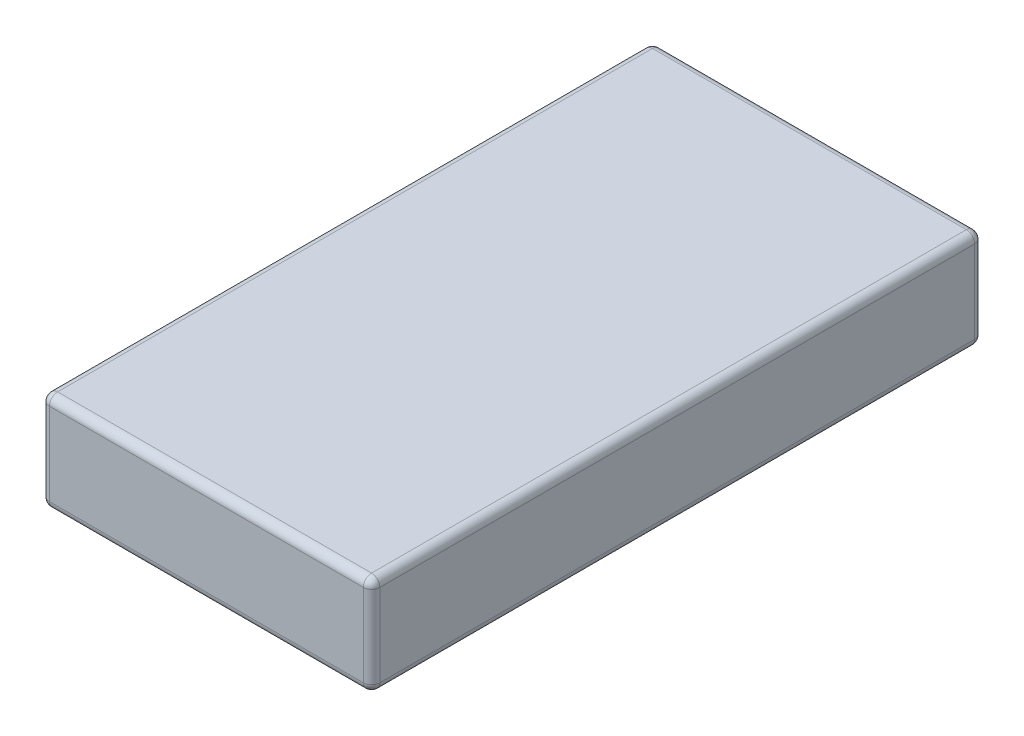
ISO-10303-21;
HEADER;
FILE_DESCRIPTION(('STEP AP214'),'2;1');
FILE_NAME('part.step','',(''),(''),'','','');
FILE_SCHEMA(('AUTOMOTIVE_DESIGN { 1 0 10303 214 1 1 1 1 }'));
ENDSEC;
DATA;
#1=APPLICATION_CONTEXT('core data for automotive mechanical design processes');
#2=APPLICATION_PROTOCOL_DEFINITION('international standard','automotive_design',2000,#1);
#3=PRODUCT_CONTEXT('',#1,'mechanical');
#4=PRODUCT('Part','Part','',(#3));
#5=PRODUCT_RELATED_PRODUCT_CATEGORY('part','',(#4));
#6=PRODUCT_DEFINITION_FORMATION('','',#4);
#7=PRODUCT_DEFINITION_CONTEXT('part definition',#1,'design');
#8=PRODUCT_DEFINITION('design','',#6,#7);
#9=PRODUCT_DEFINITION_SHAPE('','',#8);
#10=(LENGTH_UNIT() NAMED_UNIT(*) SI_UNIT(.MILLI.,.METRE.));
#11=(NAMED_UNIT(*) PLANE_ANGLE_UNIT() SI_UNIT($,.RADIAN.));
#12=(NAMED_UNIT(*) SI_UNIT($,.STERADIAN.) SOLID_ANGLE_UNIT());
#13=UNCERTAINTY_MEASURE_WITH_UNIT(LENGTH_MEASURE(1.E-05),#10,'distance_accuracy_value','');
#14=(GEOMETRIC_REPRESENTATION_CONTEXT(3) GLOBAL_UNCERTAINTY_ASSIGNED_CONTEXT((#13)) GLOBAL_UNIT_ASSIGNED_CONTEXT((#10,
#11,#12)) REPRESENTATION_CONTEXT('',''));
#15=CARTESIAN_POINT('',(0.,0.,0.));
#16=DIRECTION('',(0.,0.,1.));
#17=DIRECTION('',(1.,0.,0.));
#18=AXIS2_PLACEMENT_3D('',#15,#16,#17);
#19=CARTESIAN_POINT('',(10.,6.,18.5));
#20=DIRECTION('',(-1.,0.,0.));
#21=DIRECTION('',(0.,0.,1.));
#22=AXIS2_PLACEMENT_3D('',#19,#20,#21);
#23=PLANE('',#22);
#24=DIRECTION('',(0.,-1.,0.));
#25=VECTOR('',#24,1.);
#26=CARTESIAN_POINT('',(10.,6.,18.));
#27=LINE('',#26,#25);
#28=CARTESIAN_POINT('',(10.,5.5,18.));
#29=VERTEX_POINT('',#28);
#30=CARTESIAN_POINT('',(10.,0.5,18.));
#31=VERTEX_POINT('',#30);
#32=EDGE_CURVE('E208',#29,#31,#27,.T.);
#33=ORIENTED_EDGE('',*,*,#32,.T.);
#34=DIRECTION('',(0.,0.,-1.));
#35=VECTOR('',#34,1.);
#36=CARTESIAN_POINT('',(10.,0.5,-18.5));
#37=LINE('',#36,#35);
#38=CARTESIAN_POINT('',(10.,0.5,-18.));
#39=VERTEX_POINT('',#38);
#40=EDGE_CURVE('E212',#31,#39,#37,.T.);
#41=ORIENTED_EDGE('',*,*,#40,.T.);
#42=DIRECTION('',(0.,-1.,0.));
#43=VECTOR('',#42,1.);
#44=CARTESIAN_POINT('',(10.,6.,-18.));
#45=LINE('',#44,#43);
#46=CARTESIAN_POINT('',(10.,5.5,-18.));
#47=VERTEX_POINT('',#46);
#48=EDGE_CURVE('E205',#39,#47,#45,.F.);
#49=ORIENTED_EDGE('',*,*,#48,.T.);
#50=DIRECTION('',(0.,0.,-1.));
#51=VECTOR('',#50,1.);
#52=CARTESIAN_POINT('',(10.,5.5,18.5));
#53=LINE('',#52,#51);
#54=EDGE_CURVE('E202',#47,#29,#53,.F.);
#55=ORIENTED_EDGE('',*,*,#54,.T.);
#56=EDGE_LOOP('',(#33,#41,#49,#55));
#57=FACE_BOUND('',#56,.T.);
#58=ADVANCED_FACE('F39',(#57),#23,.F.);
#59=CARTESIAN_POINT('',(-10.,6.,-18.5));
#60=DIRECTION('',(0.,0.,1.));
#61=DIRECTION('',(1.,0.,0.));
#62=AXIS2_PLACEMENT_3D('',#59,#60,#61);
#63=PLANE('',#62);
#64=DIRECTION('',(0.,-1.,0.));
#65=VECTOR('',#64,1.);
#66=CARTESIAN_POINT('',(9.5,6.,-18.5));
#67=LINE('',#66,#65);
#68=CARTESIAN_POINT('',(9.5,5.5,-18.5));
#69=VERTEX_POINT('',#68);
#70=CARTESIAN_POINT('',(9.5,0.5,-18.5));
#71=VERTEX_POINT('',#70);
#72=EDGE_CURVE('E181',#69,#71,#67,.T.);
#73=ORIENTED_EDGE('',*,*,#72,.T.);
#74=DIRECTION('',(-1.,0.,0.));
#75=VECTOR('',#74,1.);
#76=CARTESIAN_POINT('',(-10.,0.5,-18.5));
#77=LINE('',#76,#75);
#78=CARTESIAN_POINT('',(-9.5,0.5,-18.5));
#79=VERTEX_POINT('',#78);
#80=EDGE_CURVE('E188',#71,#79,#77,.T.);
#81=ORIENTED_EDGE('',*,*,#80,.T.);
#82=DIRECTION('',(0.,-1.,0.));
#83=VECTOR('',#82,1.);
#84=CARTESIAN_POINT('',(-9.5,6.,-18.5));
#85=LINE('',#84,#83);
#86=CARTESIAN_POINT('',(-9.5,5.5,-18.5));
#87=VERTEX_POINT('',#86);
#88=EDGE_CURVE('E184',#79,#87,#85,.F.);
#89=ORIENTED_EDGE('',*,*,#88,.T.);
#90=DIRECTION('',(-1.,0.,0.));
#91=VECTOR('',#90,1.);
#92=CARTESIAN_POINT('',(-10.,5.5,-18.5));
#93=LINE('',#92,#91);
#94=EDGE_CURVE('E178',#87,#69,#93,.F.);
#95=ORIENTED_EDGE('',*,*,#94,.T.);
#96=EDGE_LOOP('',(#73,#81,#89,#95));
#97=FACE_BOUND('',#96,.T.);
#98=ADVANCED_FACE('F359',(#97),#63,.F.);
#99=CARTESIAN_POINT('',(-10.,6.,18.5));
#100=DIRECTION('',(1.,0.,0.));
#101=DIRECTION('',(0.,0.,-1.));
#102=AXIS2_PLACEMENT_3D('',#99,#100,#101);
#103=PLANE('',#102);
#104=DIRECTION('',(0.,-1.,0.));
#105=VECTOR('',#104,1.);
#106=CARTESIAN_POINT('',(-10.,6.,-18.));
#107=LINE('',#106,#105);
#108=CARTESIAN_POINT('',(-10.,5.5,-18.));
#109=VERTEX_POINT('',#108);
#110=CARTESIAN_POINT('',(-10.,0.5,-18.));
#111=VERTEX_POINT('',#110);
#112=EDGE_CURVE('E140',#109,#111,#107,.T.);
#113=ORIENTED_EDGE('',*,*,#112,.T.);
#114=DIRECTION('',(0.,0.,1.));
#115=VECTOR('',#114,1.);
#116=CARTESIAN_POINT('',(-10.,0.5,18.5));
#117=LINE('',#116,#115);
#118=CARTESIAN_POINT('',(-10.,0.5,18.));
#119=VERTEX_POINT('',#118);
#120=EDGE_CURVE('E135',#111,#119,#117,.T.);
#121=ORIENTED_EDGE('',*,*,#120,.T.);
#122=DIRECTION('',(0.,-1.,0.));
#123=VECTOR('',#122,1.);
#124=CARTESIAN_POINT('',(-10.,6.,18.));
#125=LINE('',#124,#123);
#126=CARTESIAN_POINT('',(-10.,5.5,18.));
#127=VERTEX_POINT('',#126);
#128=EDGE_CURVE('E127',#119,#127,#125,.F.);
#129=ORIENTED_EDGE('',*,*,#128,.T.);
#130=DIRECTION('',(0.,0.,1.));
#131=VECTOR('',#130,1.);
#132=CARTESIAN_POINT('',(-10.,5.5,18.5));
#133=LINE('',#132,#131);
#134=EDGE_CURVE('E132',#127,#109,#133,.F.);
#135=ORIENTED_EDGE('',*,*,#134,.T.);
#136=EDGE_LOOP('',(#113,#121,#129,#135));
#137=FACE_BOUND('',#136,.T.);
#138=ADVANCED_FACE('F130',(#137),#103,.F.);
#139=CARTESIAN_POINT('',(-10.,6.,18.5));
#140=DIRECTION('',(0.,0.,-1.));
#141=DIRECTION('',(-1.,0.,0.));
#142=AXIS2_PLACEMENT_3D('',#139,#140,#141);
#143=PLANE('',#142);
#144=DIRECTION('',(0.,-1.,0.));
#145=VECTOR('',#144,1.);
#146=CARTESIAN_POINT('',(-9.5,6.,18.5));
#147=LINE('',#146,#145);
#148=CARTESIAN_POINT('',(-9.5,5.5,18.5));
#149=VERTEX_POINT('',#148);
#150=CARTESIAN_POINT('',(-9.5,0.5,18.5));
#151=VERTEX_POINT('',#150);
#152=EDGE_CURVE('E148',#149,#151,#147,.T.);
#153=ORIENTED_EDGE('',*,*,#152,.T.);
#154=DIRECTION('',(1.,0.,0.));
#155=VECTOR('',#154,1.);
#156=CARTESIAN_POINT('',(10.,0.5,18.5));
#157=LINE('',#156,#155);
#158=CARTESIAN_POINT('',(9.5,0.5,18.5));
#159=VERTEX_POINT('',#158);
#160=EDGE_CURVE('E199',#151,#159,#157,.T.);
#161=ORIENTED_EDGE('',*,*,#160,.T.);
#162=DIRECTION('',(0.,-1.,0.));
#163=VECTOR('',#162,1.);
#164=CARTESIAN_POINT('',(9.5,6.,18.5));
#165=LINE('',#164,#163);
#166=CARTESIAN_POINT('',(9.5,5.5,18.5));
#167=VERTEX_POINT('',#166);
#168=EDGE_CURVE('E194',#159,#167,#165,.F.);
#169=ORIENTED_EDGE('',*,*,#168,.T.);
#170=DIRECTION('',(1.,0.,0.));
#171=VECTOR('',#170,1.);
#172=CARTESIAN_POINT('',(-10.,5.5,18.5));
#173=LINE('',#172,#171);
#174=EDGE_CURVE('E191',#167,#149,#173,.F.);
#175=ORIENTED_EDGE('',*,*,#174,.T.);
#176=EDGE_LOOP('',(#153,#161,#169,#175));
#177=FACE_BOUND('',#176,.T.);
#178=ADVANCED_FACE('F350',(#177),#143,.F.);
#179=CARTESIAN_POINT('',(0.,6.,0.));
#180=DIRECTION('',(0.,-1.,0.));
#181=DIRECTION('',(0.,0.,-1.));
#182=AXIS2_PLACEMENT_3D('',#179,#180,#181);
#183=PLANE('',#182);
#184=DIRECTION('',(0.,0.,1.));
#185=VECTOR('',#184,1.);
#186=CARTESIAN_POINT('',(-9.5,6.,0.));
#187=LINE('',#186,#185);
#188=CARTESIAN_POINT('',(-9.5,6.,-18.));
#189=VERTEX_POINT('',#188);
#190=CARTESIAN_POINT('',(-9.5,6.,18.));
#191=VERTEX_POINT('',#190);
#192=EDGE_CURVE('E49',#189,#191,#187,.T.);
#193=ORIENTED_EDGE('',*,*,#192,.T.);
#194=DIRECTION('',(1.,0.,0.));
#195=VECTOR('',#194,1.);
#196=CARTESIAN_POINT('',(0.,6.,18.));
#197=LINE('',#196,#195);
#198=CARTESIAN_POINT('',(9.5,6.,18.));
#199=VERTEX_POINT('',#198);
#200=EDGE_CURVE('E11',#191,#199,#197,.T.);
#201=ORIENTED_EDGE('',*,*,#200,.T.);
#202=DIRECTION('',(0.,0.,-1.));
#203=VECTOR('',#202,1.);
#204=CARTESIAN_POINT('',(9.5,6.,0.));
#205=LINE('',#204,#203);
#206=CARTESIAN_POINT('',(9.5,6.,-18.));
#207=VERTEX_POINT('',#206);
#208=EDGE_CURVE('E228',#199,#207,#205,.T.);
#209=ORIENTED_EDGE('',*,*,#208,.T.);
#210=DIRECTION('',(-1.,0.,0.));
#211=VECTOR('',#210,1.);
#212=CARTESIAN_POINT('',(0.,6.,-18.));
#213=LINE('',#212,#211);
#214=EDGE_CURVE('E60',#207,#189,#213,.T.);
#215=ORIENTED_EDGE('',*,*,#214,.T.);
#216=EDGE_LOOP('',(#193,#201,#209,#215));
#217=FACE_BOUND('',#216,.T.);
#218=ADVANCED_FACE('F352',(#217),#183,.F.);
#219=CARTESIAN_POINT('',(0.,0.,0.));
#220=DIRECTION('',(0.,-1.,0.));
#221=DIRECTION('',(0.,0.,-1.));
#222=AXIS2_PLACEMENT_3D('',#219,#220,#221);
#223=PLANE('',#222);
#224=DIRECTION('',(0.,0.,1.));
#225=VECTOR('',#224,1.);
#226=CARTESIAN_POINT('',(-9.5,0.,-18.5));
#227=LINE('',#226,#225);
#228=CARTESIAN_POINT('',(-9.5,0.,18.));
#229=VERTEX_POINT('',#228);
#230=CARTESIAN_POINT('',(-9.5,0.,-18.));
#231=VERTEX_POINT('',#230);
#232=EDGE_CURVE('E221',#229,#231,#227,.F.);
#233=ORIENTED_EDGE('',*,*,#232,.T.);
#234=DIRECTION('',(-1.,0.,0.));
#235=VECTOR('',#234,1.);
#236=CARTESIAN_POINT('',(10.,0.,-18.));
#237=LINE('',#236,#235);
#238=CARTESIAN_POINT('',(9.5,0.,-18.));
#239=VERTEX_POINT('',#238);
#240=EDGE_CURVE('E224',#231,#239,#237,.F.);
#241=ORIENTED_EDGE('',*,*,#240,.T.);
#242=DIRECTION('',(0.,0.,-1.));
#243=VECTOR('',#242,1.);
#244=CARTESIAN_POINT('',(9.5,0.,18.5));
#245=LINE('',#244,#243);
#246=CARTESIAN_POINT('',(9.5,0.,18.));
#247=VERTEX_POINT('',#246);
#248=EDGE_CURVE('E215',#239,#247,#245,.F.);
#249=ORIENTED_EDGE('',*,*,#248,.T.);
#250=DIRECTION('',(1.,0.,0.));
#251=VECTOR('',#250,1.);
#252=CARTESIAN_POINT('',(-10.,0.,18.));
#253=LINE('',#252,#251);
#254=EDGE_CURVE('E218',#247,#229,#253,.F.);
#255=ORIENTED_EDGE('',*,*,#254,.T.);
#256=EDGE_LOOP('',(#233,#241,#249,#255));
#257=FACE_BOUND('',#256,.T.);
#258=ADVANCED_FACE('F319',(#257),#223,.T.);
#259=CARTESIAN_POINT('',(9.5,6.,18.));
#260=DIRECTION('',(0.,-1.,0.));
#261=DIRECTION('',(0.,0.,-1.));
#262=AXIS2_PLACEMENT_3D('',#259,#260,#261);
#263=CYLINDRICAL_SURFACE('',#262,0.5);
#264=CARTESIAN_POINT('',(9.5,5.5,18.));
#265=DIRECTION('',(0.,1.,0.));
#266=DIRECTION('',(0.,0.,1.));
#267=AXIS2_PLACEMENT_3D('',#264,#265,#266);
#268=CIRCLE('',#267,0.5);
#269=EDGE_CURVE('E43',#167,#29,#268,.T.);
#270=ORIENTED_EDGE('',*,*,#269,.F.);
#271=ORIENTED_EDGE('',*,*,#168,.F.);
#272=CARTESIAN_POINT('',(9.5,0.5,18.));
#273=DIRECTION('',(0.,-1.,0.));
#274=DIRECTION('',(0.,0.,-1.));
#275=AXIS2_PLACEMENT_3D('',#272,#273,#274);
#276=CIRCLE('',#275,0.5);
#277=EDGE_CURVE('E172',#31,#159,#276,.T.);
#278=ORIENTED_EDGE('',*,*,#277,.F.);
#279=ORIENTED_EDGE('',*,*,#32,.F.);
#280=EDGE_LOOP('',(#270,#271,#278,#279));
#281=FACE_BOUND('',#280,.T.);
#282=ADVANCED_FACE('F41',(#281),#263,.T.);
#283=CARTESIAN_POINT('',(9.5,5.5,18.));
#284=DIRECTION('',(1.,0.,0.));
#285=DIRECTION('',(0.,0.,-1.));
#286=AXIS2_PLACEMENT_3D('',#283,#284,#285);
#287=SPHERICAL_SURFACE('',#286,0.5);
#288=CARTESIAN_POINT('',(9.5,5.5,18.));
#289=DIRECTION('',(1.,0.,0.));
#290=DIRECTION('',(0.,0.,-1.));
#291=AXIS2_PLACEMENT_3D('',#288,#289,#290);
#292=CIRCLE('',#291,0.5);
#293=EDGE_CURVE('E295',#167,#199,#292,.F.);
#294=ORIENTED_EDGE('',*,*,#293,.F.);
#295=ORIENTED_EDGE('',*,*,#269,.T.);
#296=CARTESIAN_POINT('',(9.5,5.5,18.));
#297=DIRECTION('',(0.,0.,1.));
#298=DIRECTION('',(1.,0.,0.));
#299=AXIS2_PLACEMENT_3D('',#296,#297,#298);
#300=CIRCLE('',#299,0.5);
#301=EDGE_CURVE('E299',#199,#29,#300,.F.);
#302=ORIENTED_EDGE('',*,*,#301,.F.);
#303=EDGE_LOOP('',(#294,#295,#302));
#304=FACE_BOUND('',#303,.T.);
#305=ADVANCED_FACE('F345',(#304),#287,.T.);
#306=CARTESIAN_POINT('',(9.5,0.5,18.));
#307=DIRECTION('',(0.,0.,1.));
#308=DIRECTION('',(0.,-1.,0.));
#309=AXIS2_PLACEMENT_3D('',#306,#307,#308);
#310=SPHERICAL_SURFACE('',#309,0.5);
#311=CARTESIAN_POINT('',(9.5,0.5,18.));
#312=DIRECTION('',(0.,0.,1.));
#313=DIRECTION('',(1.,0.,0.));
#314=AXIS2_PLACEMENT_3D('',#311,#312,#313);
#315=CIRCLE('',#314,0.5);
#316=EDGE_CURVE('E287',#31,#247,#315,.F.);
#317=ORIENTED_EDGE('',*,*,#316,.F.);
#318=ORIENTED_EDGE('',*,*,#277,.T.);
#319=CARTESIAN_POINT('',(9.5,0.5,18.));
#320=DIRECTION('',(1.,0.,0.));
#321=DIRECTION('',(0.,0.,-1.));
#322=AXIS2_PLACEMENT_3D('',#319,#320,#321);
#323=CIRCLE('',#322,0.5);
#324=EDGE_CURVE('E291',#247,#159,#323,.F.);
#325=ORIENTED_EDGE('',*,*,#324,.F.);
#326=EDGE_LOOP('',(#317,#318,#325));
#327=FACE_BOUND('',#326,.T.);
#328=ADVANCED_FACE('F308',(#327),#310,.T.);
#329=CARTESIAN_POINT('',(9.5,5.5,0.));
#330=DIRECTION('',(0.,0.,-1.));
#331=DIRECTION('',(-1.,0.,0.));
#332=AXIS2_PLACEMENT_3D('',#329,#330,#331);
#333=CYLINDRICAL_SURFACE('',#332,0.5);
#334=ORIENTED_EDGE('',*,*,#301,.T.);
#335=ORIENTED_EDGE('',*,*,#54,.F.);
#336=CARTESIAN_POINT('',(9.5,5.5,-18.));
#337=DIRECTION('',(0.,0.,-1.));
#338=DIRECTION('',(-1.,0.,0.));
#339=AXIS2_PLACEMENT_3D('',#336,#337,#338);
#340=CIRCLE('',#339,0.5);
#341=EDGE_CURVE('E279',#207,#47,#340,.T.);
#342=ORIENTED_EDGE('',*,*,#341,.F.);
#343=ORIENTED_EDGE('',*,*,#208,.F.);
#344=EDGE_LOOP('',(#334,#335,#342,#343));
#345=FACE_BOUND('',#344,.T.);
#346=ADVANCED_FACE('F340',(#345),#333,.T.);
#347=CARTESIAN_POINT('',(0.,5.5,18.));
#348=DIRECTION('',(1.,0.,0.));
#349=DIRECTION('',(0.,0.,-1.));
#350=AXIS2_PLACEMENT_3D('',#347,#348,#349);
#351=CYLINDRICAL_SURFACE('',#350,0.5);
#352=ORIENTED_EDGE('',*,*,#293,.T.);
#353=ORIENTED_EDGE('',*,*,#200,.F.);
#354=CARTESIAN_POINT('',(-9.5,5.5,18.));
#355=DIRECTION('',(-1.,0.,0.));
#356=DIRECTION('',(0.,0.,1.));
#357=AXIS2_PLACEMENT_3D('',#354,#355,#356);
#358=CIRCLE('',#357,0.5);
#359=EDGE_CURVE('E153',#149,#191,#358,.T.);
#360=ORIENTED_EDGE('',*,*,#359,.F.);
#361=ORIENTED_EDGE('',*,*,#174,.F.);
#362=EDGE_LOOP('',(#352,#353,#360,#361));
#363=FACE_BOUND('',#362,.T.);
#364=ADVANCED_FACE('F348',(#363),#351,.T.);
#365=CARTESIAN_POINT('',(-9.5,6.,18.));
#366=DIRECTION('',(0.,-1.,0.));
#367=DIRECTION('',(0.,0.,-1.));
#368=AXIS2_PLACEMENT_3D('',#365,#366,#367);
#369=CYLINDRICAL_SURFACE('',#368,0.5);
#370=CARTESIAN_POINT('',(-9.5,0.5,18.));
#371=DIRECTION('',(0.,-1.,0.));
#372=DIRECTION('',(0.,0.,-1.));
#373=AXIS2_PLACEMENT_3D('',#370,#371,#372);
#374=CIRCLE('',#373,0.5);
#375=EDGE_CURVE('E154',#151,#119,#374,.T.);
#376=ORIENTED_EDGE('',*,*,#375,.F.);
#377=ORIENTED_EDGE('',*,*,#152,.F.);
#378=CARTESIAN_POINT('',(-9.5,5.5,18.));
#379=DIRECTION('',(0.,1.,0.));
#380=DIRECTION('',(0.,0.,1.));
#381=AXIS2_PLACEMENT_3D('',#378,#379,#380);
#382=CIRCLE('',#381,0.5);
#383=EDGE_CURVE('E144',#127,#149,#382,.T.);
#384=ORIENTED_EDGE('',*,*,#383,.F.);
#385=ORIENTED_EDGE('',*,*,#128,.F.);
#386=EDGE_LOOP('',(#376,#377,#384,#385));
#387=FACE_BOUND('',#386,.T.);
#388=ADVANCED_FACE('F146',(#387),#369,.T.);
#389=CARTESIAN_POINT('',(-10.,0.5,18.));
#390=DIRECTION('',(-1.,0.,0.));
#391=DIRECTION('',(0.,0.,1.));
#392=AXIS2_PLACEMENT_3D('',#389,#390,#391);
#393=CYLINDRICAL_SURFACE('',#392,0.5);
#394=ORIENTED_EDGE('',*,*,#324,.T.);
#395=ORIENTED_EDGE('',*,*,#160,.F.);
#396=CARTESIAN_POINT('',(-9.5,0.5,18.));
#397=DIRECTION('',(-1.,0.,0.));
#398=DIRECTION('',(0.,0.,1.));
#399=AXIS2_PLACEMENT_3D('',#396,#397,#398);
#400=CIRCLE('',#399,0.5);
#401=EDGE_CURVE('E272',#229,#151,#400,.T.);
#402=ORIENTED_EDGE('',*,*,#401,.F.);
#403=ORIENTED_EDGE('',*,*,#254,.F.);
#404=EDGE_LOOP('',(#394,#395,#402,#403));
#405=FACE_BOUND('',#404,.T.);
#406=ADVANCED_FACE('F315',(#405),#393,.T.);
#407=CARTESIAN_POINT('',(9.5,0.5,18.5));
#408=DIRECTION('',(0.,0.,1.));
#409=DIRECTION('',(1.,0.,0.));
#410=AXIS2_PLACEMENT_3D('',#407,#408,#409);
#411=CYLINDRICAL_SURFACE('',#410,0.5);
#412=ORIENTED_EDGE('',*,*,#316,.T.);
#413=ORIENTED_EDGE('',*,*,#248,.F.);
#414=CARTESIAN_POINT('',(9.5,0.5,-18.));
#415=DIRECTION('',(0.,0.,-1.));
#416=DIRECTION('',(-1.,0.,0.));
#417=AXIS2_PLACEMENT_3D('',#414,#415,#416);
#418=CIRCLE('',#417,0.5);
#419=EDGE_CURVE('E268',#39,#239,#418,.T.);
#420=ORIENTED_EDGE('',*,*,#419,.F.);
#421=ORIENTED_EDGE('',*,*,#40,.F.);
#422=EDGE_LOOP('',(#412,#413,#420,#421));
#423=FACE_BOUND('',#422,.T.);
#424=ADVANCED_FACE('F325',(#423),#411,.T.);
#425=CARTESIAN_POINT('',(9.5,6.,-18.));
#426=DIRECTION('',(0.,-1.,0.));
#427=DIRECTION('',(0.,0.,-1.));
#428=AXIS2_PLACEMENT_3D('',#425,#426,#427);
#429=CYLINDRICAL_SURFACE('',#428,0.5);
#430=CARTESIAN_POINT('',(9.5,5.5,-18.));
#431=DIRECTION('',(0.,1.,0.));
#432=DIRECTION('',(0.,0.,1.));
#433=AXIS2_PLACEMENT_3D('',#430,#431,#432);
#434=CIRCLE('',#433,0.5);
#435=EDGE_CURVE('E283',#47,#69,#434,.T.);
#436=ORIENTED_EDGE('',*,*,#435,.F.);
#437=ORIENTED_EDGE('',*,*,#48,.F.);
#438=CARTESIAN_POINT('',(9.5,0.5,-18.));
#439=DIRECTION('',(0.,-1.,0.));
#440=DIRECTION('',(0.,0.,-1.));
#441=AXIS2_PLACEMENT_3D('',#438,#439,#440);
#442=CIRCLE('',#441,0.5);
#443=EDGE_CURVE('E264',#71,#39,#442,.T.);
#444=ORIENTED_EDGE('',*,*,#443,.F.);
#445=ORIENTED_EDGE('',*,*,#72,.F.);
#446=EDGE_LOOP('',(#436,#437,#444,#445));
#447=FACE_BOUND('',#446,.T.);
#448=ADVANCED_FACE('F332',(#447),#429,.T.);
#449=CARTESIAN_POINT('',(9.5,5.5,-18.));
#450=DIRECTION('',(1.,0.,0.));
#451=DIRECTION('',(0.,0.,-1.));
#452=AXIS2_PLACEMENT_3D('',#449,#450,#451);
#453=SPHERICAL_SURFACE('',#452,0.5);
#454=ORIENTED_EDGE('',*,*,#341,.T.);
#455=ORIENTED_EDGE('',*,*,#435,.T.);
#456=CARTESIAN_POINT('',(9.5,5.5,-18.));
#457=DIRECTION('',(1.,0.,0.));
#458=DIRECTION('',(0.,0.,-1.));
#459=AXIS2_PLACEMENT_3D('',#456,#457,#458);
#460=CIRCLE('',#459,0.5);
#461=EDGE_CURVE('E161',#207,#69,#460,.F.);
#462=ORIENTED_EDGE('',*,*,#461,.F.);
#463=EDGE_LOOP('',(#454,#455,#462));
#464=FACE_BOUND('',#463,.T.);
#465=ADVANCED_FACE('F338',(#464),#453,.T.);
#466=CARTESIAN_POINT('',(-9.5,5.5,18.));
#467=DIRECTION('',(0.,0.,1.));
#468=DIRECTION('',(1.,0.,0.));
#469=AXIS2_PLACEMENT_3D('',#466,#467,#468);
#470=SPHERICAL_SURFACE('',#469,0.5);
#471=ORIENTED_EDGE('',*,*,#383,.T.);
#472=ORIENTED_EDGE('',*,*,#359,.T.);
#473=CARTESIAN_POINT('',(-9.5,5.5,18.));
#474=DIRECTION('',(0.,0.,1.));
#475=DIRECTION('',(1.,0.,0.));
#476=AXIS2_PLACEMENT_3D('',#473,#474,#475);
#477=CIRCLE('',#476,0.5);
#478=EDGE_CURVE('E157',#127,#191,#477,.F.);
#479=ORIENTED_EDGE('',*,*,#478,.F.);
#480=EDGE_LOOP('',(#471,#472,#479));
#481=FACE_BOUND('',#480,.T.);
#482=ADVANCED_FACE('F158',(#481),#470,.T.);
#483=CARTESIAN_POINT('',(-9.5,0.5,18.));
#484=DIRECTION('',(0.,0.,1.));
#485=DIRECTION('',(0.,-1.,0.));
#486=AXIS2_PLACEMENT_3D('',#483,#484,#485);
#487=SPHERICAL_SURFACE('',#486,0.5);
#488=ORIENTED_EDGE('',*,*,#401,.T.);
#489=ORIENTED_EDGE('',*,*,#375,.T.);
#490=CARTESIAN_POINT('',(-9.5,0.5,18.));
#491=DIRECTION('',(0.,0.,1.));
#492=DIRECTION('',(1.,0.,0.));
#493=AXIS2_PLACEMENT_3D('',#490,#491,#492);
#494=CIRCLE('',#493,0.5);
#495=EDGE_CURVE('E162',#229,#119,#494,.F.);
#496=ORIENTED_EDGE('',*,*,#495,.F.);
#497=EDGE_LOOP('',(#488,#489,#496));
#498=FACE_BOUND('',#497,.T.);
#499=ADVANCED_FACE('F399',(#498),#487,.T.);
#500=CARTESIAN_POINT('',(9.5,0.5,-18.));
#501=DIRECTION('',(1.,0.,0.));
#502=DIRECTION('',(0.,1.,0.));
#503=AXIS2_PLACEMENT_3D('',#500,#501,#502);
#504=SPHERICAL_SURFACE('',#503,0.5);
#505=ORIENTED_EDGE('',*,*,#443,.T.);
#506=ORIENTED_EDGE('',*,*,#419,.T.);
#507=CARTESIAN_POINT('',(9.5,0.5,-18.));
#508=DIRECTION('',(1.,0.,0.));
#509=DIRECTION('',(0.,0.,-1.));
#510=AXIS2_PLACEMENT_3D('',#507,#508,#509);
#511=CIRCLE('',#510,0.5);
#512=EDGE_CURVE('E255',#71,#239,#511,.F.);
#513=ORIENTED_EDGE('',*,*,#512,.F.);
#514=EDGE_LOOP('',(#505,#506,#513));
#515=FACE_BOUND('',#514,.T.);
#516=ADVANCED_FACE('F395',(#515),#504,.T.);
#517=CARTESIAN_POINT('',(0.,5.5,-18.));
#518=DIRECTION('',(-1.,0.,0.));
#519=DIRECTION('',(0.,0.,1.));
#520=AXIS2_PLACEMENT_3D('',#517,#518,#519);
#521=CYLINDRICAL_SURFACE('',#520,0.5);
#522=ORIENTED_EDGE('',*,*,#461,.T.);
#523=ORIENTED_EDGE('',*,*,#94,.F.);
#524=CARTESIAN_POINT('',(-9.5,5.5,-18.));
#525=DIRECTION('',(-1.,0.,0.));
#526=DIRECTION('',(0.,0.,1.));
#527=AXIS2_PLACEMENT_3D('',#524,#525,#526);
#528=CIRCLE('',#527,0.5);
#529=EDGE_CURVE('E251',#189,#87,#528,.T.);
#530=ORIENTED_EDGE('',*,*,#529,.F.);
#531=ORIENTED_EDGE('',*,*,#214,.F.);
#532=EDGE_LOOP('',(#522,#523,#530,#531));
#533=FACE_BOUND('',#532,.T.);
#534=ADVANCED_FACE('F392',(#533),#521,.T.);
#535=CARTESIAN_POINT('',(-9.5,5.5,0.));
#536=DIRECTION('',(0.,0.,1.));
#537=DIRECTION('',(1.,0.,0.));
#538=AXIS2_PLACEMENT_3D('',#535,#536,#537);
#539=CYLINDRICAL_SURFACE('',#538,0.5);
#540=ORIENTED_EDGE('',*,*,#478,.T.);
#541=ORIENTED_EDGE('',*,*,#192,.F.);
#542=CARTESIAN_POINT('',(-9.5,5.5,-18.));
#543=DIRECTION('',(0.,0.,-1.));
#544=DIRECTION('',(-1.,0.,0.));
#545=AXIS2_PLACEMENT_3D('',#542,#543,#544);
#546=CIRCLE('',#545,0.5);
#547=EDGE_CURVE('E166',#109,#189,#546,.T.);
#548=ORIENTED_EDGE('',*,*,#547,.F.);
#549=ORIENTED_EDGE('',*,*,#134,.F.);
#550=EDGE_LOOP('',(#540,#541,#548,#549));
#551=FACE_BOUND('',#550,.T.);
#552=ADVANCED_FACE('F164',(#551),#539,.T.);
#553=CARTESIAN_POINT('',(-9.5,0.5,18.5));
#554=DIRECTION('',(0.,0.,-1.));
#555=DIRECTION('',(-1.,0.,0.));
#556=AXIS2_PLACEMENT_3D('',#553,#554,#555);
#557=CYLINDRICAL_SURFACE('',#556,0.5);
#558=ORIENTED_EDGE('',*,*,#495,.T.);
#559=ORIENTED_EDGE('',*,*,#120,.F.);
#560=CARTESIAN_POINT('',(-9.5,0.5,-18.));
#561=DIRECTION('',(0.,0.,-1.));
#562=DIRECTION('',(-1.,0.,0.));
#563=AXIS2_PLACEMENT_3D('',#560,#561,#562);
#564=CIRCLE('',#563,0.5);
#565=EDGE_CURVE('E245',#231,#111,#564,.T.);
#566=ORIENTED_EDGE('',*,*,#565,.F.);
#567=ORIENTED_EDGE('',*,*,#232,.F.);
#568=EDGE_LOOP('',(#558,#559,#566,#567));
#569=FACE_BOUND('',#568,.T.);
#570=ADVANCED_FACE('F385',(#569),#557,.T.);
#571=CARTESIAN_POINT('',(-10.,0.5,-18.));
#572=DIRECTION('',(1.,0.,0.));
#573=DIRECTION('',(0.,0.,-1.));
#574=AXIS2_PLACEMENT_3D('',#571,#572,#573);
#575=CYLINDRICAL_SURFACE('',#574,0.5);
#576=ORIENTED_EDGE('',*,*,#512,.T.);
#577=ORIENTED_EDGE('',*,*,#240,.F.);
#578=CARTESIAN_POINT('',(-9.5,0.5,-18.));
#579=DIRECTION('',(-1.,0.,0.));
#580=DIRECTION('',(0.,0.,1.));
#581=AXIS2_PLACEMENT_3D('',#578,#579,#580);
#582=CIRCLE('',#581,0.5);
#583=EDGE_CURVE('E241',#79,#231,#582,.T.);
#584=ORIENTED_EDGE('',*,*,#583,.F.);
#585=ORIENTED_EDGE('',*,*,#80,.F.);
#586=EDGE_LOOP('',(#576,#577,#584,#585));
#587=FACE_BOUND('',#586,.T.);
#588=ADVANCED_FACE('F381',(#587),#575,.T.);
#589=CARTESIAN_POINT('',(-9.5,5.5,-18.));
#590=DIRECTION('',(0.,1.,0.));
#591=DIRECTION('',(0.,0.,1.));
#592=AXIS2_PLACEMENT_3D('',#589,#590,#591);
#593=SPHERICAL_SURFACE('',#592,0.5);
#594=ORIENTED_EDGE('',*,*,#547,.T.);
#595=ORIENTED_EDGE('',*,*,#529,.T.);
#596=CARTESIAN_POINT('',(-9.5,5.5,-18.));
#597=DIRECTION('',(0.,1.,0.));
#598=DIRECTION('',(0.,0.,1.));
#599=AXIS2_PLACEMENT_3D('',#596,#597,#598);
#600=CIRCLE('',#599,0.5);
#601=EDGE_CURVE('E238',#109,#87,#600,.F.);
#602=ORIENTED_EDGE('',*,*,#601,.F.);
#603=EDGE_LOOP('',(#594,#595,#602));
#604=FACE_BOUND('',#603,.T.);
#605=ADVANCED_FACE('F377',(#604),#593,.T.);
#606=CARTESIAN_POINT('',(-9.5,0.5,-18.));
#607=DIRECTION('',(0.,-1.,0.));
#608=DIRECTION('',(0.,0.,-1.));
#609=AXIS2_PLACEMENT_3D('',#606,#607,#608);
#610=SPHERICAL_SURFACE('',#609,0.5);
#611=ORIENTED_EDGE('',*,*,#583,.T.);
#612=ORIENTED_EDGE('',*,*,#565,.T.);
#613=CARTESIAN_POINT('',(-9.5,0.5,-18.));
#614=DIRECTION('',(0.,-1.,0.));
#615=DIRECTION('',(0.,0.,-1.));
#616=AXIS2_PLACEMENT_3D('',#613,#614,#615);
#617=CIRCLE('',#616,0.5);
#618=EDGE_CURVE('E235',#79,#111,#617,.F.);
#619=ORIENTED_EDGE('',*,*,#618,.F.);
#620=EDGE_LOOP('',(#611,#612,#619));
#621=FACE_BOUND('',#620,.T.);
#622=ADVANCED_FACE('F373',(#621),#610,.T.);
#623=CARTESIAN_POINT('',(-9.5,6.,-18.));
#624=DIRECTION('',(0.,-1.,0.));
#625=DIRECTION('',(0.,0.,-1.));
#626=AXIS2_PLACEMENT_3D('',#623,#624,#625);
#627=CYLINDRICAL_SURFACE('',#626,0.5);
#628=ORIENTED_EDGE('',*,*,#601,.T.);
#629=ORIENTED_EDGE('',*,*,#88,.F.);
#630=ORIENTED_EDGE('',*,*,#618,.T.);
#631=ORIENTED_EDGE('',*,*,#112,.F.);
#632=EDGE_LOOP('',(#628,#629,#630,#631));
#633=FACE_BOUND('',#632,.T.);
#634=ADVANCED_FACE('F370',(#633),#627,.T.);
#635=CLOSED_SHELL('',(#58,#98,#138,#178,#218,#258,#282,#305,#328,#346,#364,#388,#406,#424,#448,
#465,#482,#499,#516,#534,#552,#570,#588,#605,#622,#634));
#636=MANIFOLD_SOLID_BREP('B2',#635);
#637=ADVANCED_BREP_SHAPE_REPRESENTATION('',(#18,#636),#14);
#638=SHAPE_DEFINITION_REPRESENTATION(#9,#637);
ENDSEC;
END-ISO-10303-21;
